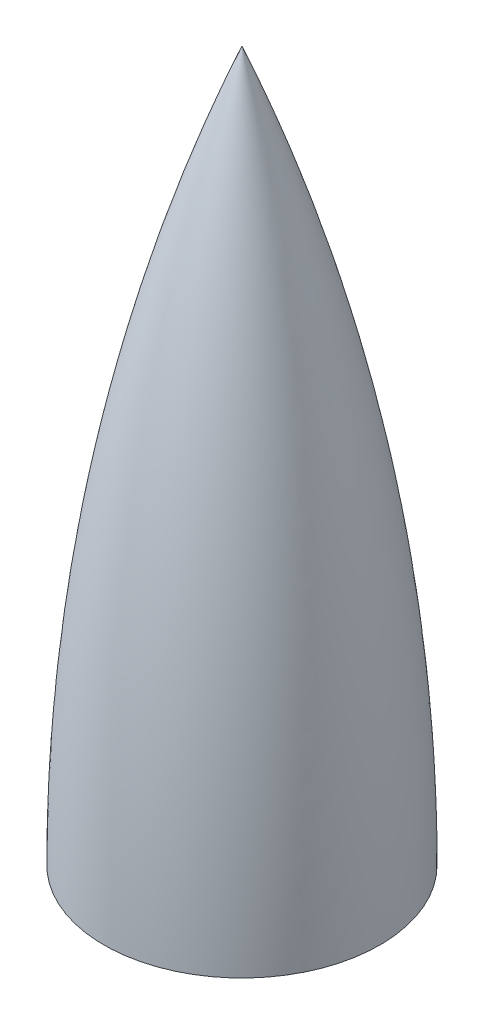
ISO-10303-21;
HEADER;
FILE_DESCRIPTION(('STEP AP214'),'2;1');
FILE_NAME('part.step','',(''),(''),'','','');
FILE_SCHEMA(('AUTOMOTIVE_DESIGN { 1 0 10303 214 1 1 1 1 }'));
ENDSEC;
DATA;
#1=APPLICATION_CONTEXT('core data for automotive mechanical design processes');
#2=APPLICATION_PROTOCOL_DEFINITION('international standard','automotive_design',2000,#1);
#3=PRODUCT_CONTEXT('',#1,'mechanical');
#4=PRODUCT('Part','Part','',(#3));
#5=PRODUCT_RELATED_PRODUCT_CATEGORY('part','',(#4));
#6=PRODUCT_DEFINITION_FORMATION('','',#4);
#7=PRODUCT_DEFINITION_CONTEXT('part definition',#1,'design');
#8=PRODUCT_DEFINITION('design','',#6,#7);
#9=PRODUCT_DEFINITION_SHAPE('','',#8);
#10=(LENGTH_UNIT() NAMED_UNIT(*) SI_UNIT(.MILLI.,.METRE.));
#11=(NAMED_UNIT(*) PLANE_ANGLE_UNIT() SI_UNIT($,.RADIAN.));
#12=(NAMED_UNIT(*) SI_UNIT($,.STERADIAN.) SOLID_ANGLE_UNIT());
#13=UNCERTAINTY_MEASURE_WITH_UNIT(LENGTH_MEASURE(1.E-05),#10,'distance_accuracy_value','');
#14=(GEOMETRIC_REPRESENTATION_CONTEXT(3) GLOBAL_UNCERTAINTY_ASSIGNED_CONTEXT((#13)) GLOBAL_UNIT_ASSIGNED_CONTEXT((#10,
#11,#12)) REPRESENTATION_CONTEXT('',''));
#15=CARTESIAN_POINT('',(0.,0.,0.));
#16=DIRECTION('',(0.,0.,1.));
#17=DIRECTION('',(1.,0.,0.));
#18=AXIS2_PLACEMENT_3D('',#15,#16,#17);
#19=CARTESIAN_POINT('',(0.,0.,0.));
#20=DIRECTION('',(0.,-1.,0.));
#21=DIRECTION('',(0.,0.,-1.));
#22=AXIS2_PLACEMENT_3D('',#19,#20,#21);
#23=PLANE('',#22);
#24=CARTESIAN_POINT('',(0.,0.,0.));
#25=DIRECTION('',(0.,-1.,0.));
#26=DIRECTION('',(0.,0.,-1.));
#27=AXIS2_PLACEMENT_3D('',#24,#25,#26);
#28=CIRCLE('',#27,3500.);
#29=CARTESIAN_POINT('',(0.,0.,-3500.));
#30=VERTEX_POINT('',#29);
#31=EDGE_CURVE('E12',#30,#30,#28,.T.);
#32=ORIENTED_EDGE('',*,*,#31,.T.);
#33=EDGE_LOOP('',(#32));
#34=FACE_BOUND('',#33,.T.);
#35=ADVANCED_FACE('F40',(#34),#23,.T.);
#36=CARTESIAN_POINT('',(0.,0.138888927931902,44534.9999997992));
#37=DIRECTION('',(-1.,0.,0.));
#38=DIRECTION('',(0.,0.,-1.));
#39=AXIS2_PLACEMENT_3D('',#36,#37,#38);
#40=CIRCLE('',#39,48035.);
#41=TRIMMED_CURVE('',#40,(PARAMETER_VALUE(-0.384098925892472)),
(PARAMETER_VALUE(0.384098925892472)),.T.,.PARAMETER.);
#42=CARTESIAN_POINT('',(0.,0.138888927931902,0.));
#43=DIRECTION('',(0.,-1.,0.));
#44=AXIS1_PLACEMENT('',#42,#43);
#45=SURFACE_OF_REVOLUTION('',#41,#44);
#46=CARTESIAN_POINT('',(-7.105427357601E-12,18000.,0.));
#47=VERTEX_POINT('',#46);
#48=VERTEX_LOOP('',#47);
#49=FACE_BOUND('',#48,.T.);
#50=ORIENTED_EDGE('',*,*,#31,.F.);
#51=EDGE_LOOP('',(#50));
#52=FACE_BOUND('',#51,.T.);
#53=ADVANCED_FACE('F49',(#49,#52),#45,.T.);
#54=CLOSED_SHELL('',(#35,#53));
#55=MANIFOLD_SOLID_BREP('B2',#54);
#56=ADVANCED_BREP_SHAPE_REPRESENTATION('',(#18,#55),#14);
#57=SHAPE_DEFINITION_REPRESENTATION(#9,#56);
ENDSEC;
END-ISO-10303-21;
